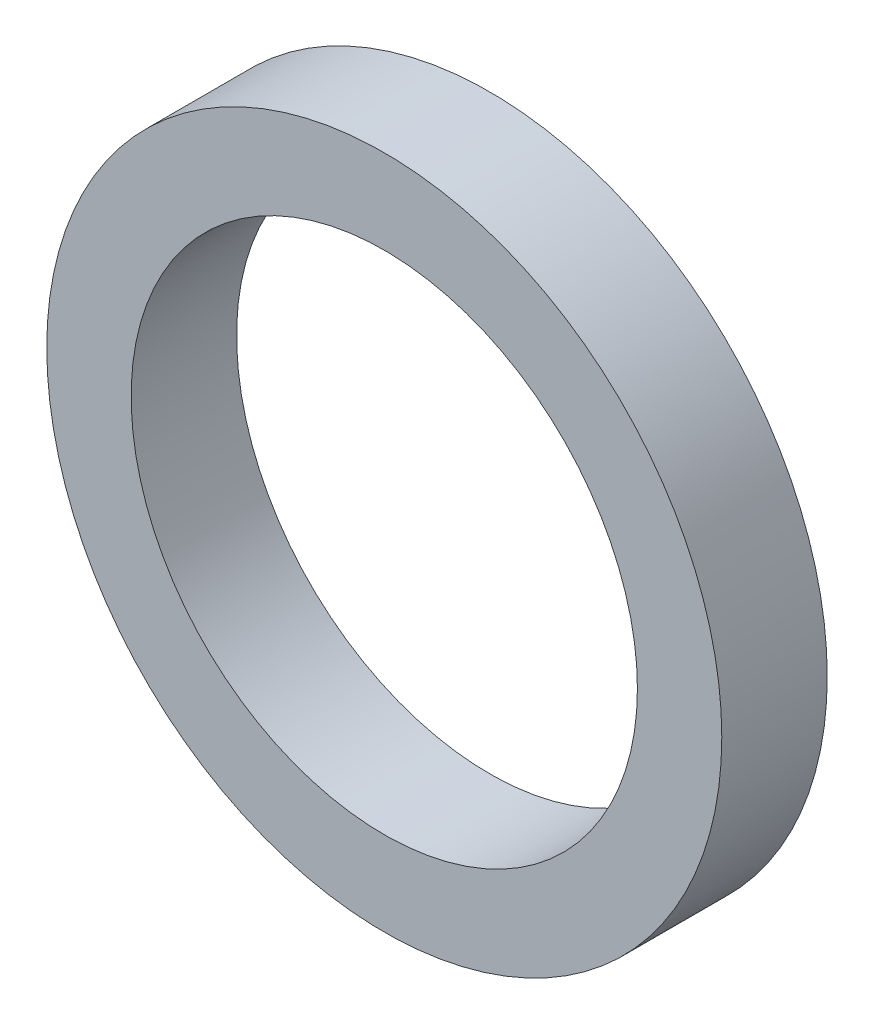
ISO-10303-21;
HEADER;
FILE_DESCRIPTION(('STEP AP214'),'2;1');
FILE_NAME('part.step','',(''),(''),'','','');
FILE_SCHEMA(('AUTOMOTIVE_DESIGN { 1 0 10303 214 1 1 1 1 }'));
ENDSEC;
DATA;
#1=APPLICATION_CONTEXT('core data for automotive mechanical design processes');
#2=APPLICATION_PROTOCOL_DEFINITION('international standard','automotive_design',2000,#1);
#3=PRODUCT_CONTEXT('',#1,'mechanical');
#4=PRODUCT('Part','Part','',(#3));
#5=PRODUCT_RELATED_PRODUCT_CATEGORY('part','',(#4));
#6=PRODUCT_DEFINITION_FORMATION('','',#4);
#7=PRODUCT_DEFINITION_CONTEXT('part definition',#1,'design');
#8=PRODUCT_DEFINITION('design','',#6,#7);
#9=PRODUCT_DEFINITION_SHAPE('','',#8);
#10=(LENGTH_UNIT() NAMED_UNIT(*) SI_UNIT(.MILLI.,.METRE.));
#11=(NAMED_UNIT(*) PLANE_ANGLE_UNIT() SI_UNIT($,.RADIAN.));
#12=(NAMED_UNIT(*) SI_UNIT($,.STERADIAN.) SOLID_ANGLE_UNIT());
#13=UNCERTAINTY_MEASURE_WITH_UNIT(LENGTH_MEASURE(1.E-05),#10,'distance_accuracy_value','');
#14=(GEOMETRIC_REPRESENTATION_CONTEXT(3) GLOBAL_UNCERTAINTY_ASSIGNED_CONTEXT((#13)) GLOBAL_UNIT_ASSIGNED_CONTEXT((#10,
#11,#12)) REPRESENTATION_CONTEXT('',''));
#15=CARTESIAN_POINT('',(0.,0.,0.));
#16=DIRECTION('',(0.,0.,1.));
#17=DIRECTION('',(1.,0.,0.));
#18=AXIS2_PLACEMENT_3D('',#15,#16,#17);
#19=CARTESIAN_POINT('',(0.,0.,3.96748));
#20=DIRECTION('',(0.,0.,1.));
#21=DIRECTION('',(1.,0.,0.));
#22=AXIS2_PLACEMENT_3D('',#19,#20,#21);
#23=PLANE('',#22);
#24=CARTESIAN_POINT('',(0.,0.,3.96748));
#25=DIRECTION('',(0.,0.,1.));
#26=DIRECTION('',(1.,0.,0.));
#27=AXIS2_PLACEMENT_3D('',#24,#25,#26);
#28=CIRCLE('',#27,12.7);
#29=CARTESIAN_POINT('',(12.7,0.,3.96748));
#30=VERTEX_POINT('',#29);
#31=EDGE_CURVE('E10',#30,#30,#28,.T.);
#32=ORIENTED_EDGE('',*,*,#31,.T.);
#33=EDGE_LOOP('',(#32));
#34=FACE_BOUND('',#33,.T.);
#35=CARTESIAN_POINT('',(0.,0.,3.96748));
#36=DIRECTION('',(0.,0.,1.));
#37=DIRECTION('',(1.,0.,0.));
#38=AXIS2_PLACEMENT_3D('',#35,#36,#37);
#39=CIRCLE('',#38,9.525);
#40=CARTESIAN_POINT('',(9.525,0.,3.96748));
#41=VERTEX_POINT('',#40);
#42=EDGE_CURVE('E41',#41,#41,#39,.T.);
#43=ORIENTED_EDGE('',*,*,#42,.F.);
#44=EDGE_LOOP('',(#43));
#45=FACE_BOUND('',#44,.T.);
#46=ADVANCED_FACE('F30',(#34,#45),#23,.T.);
#47=CARTESIAN_POINT('',(0.,0.,0.));
#48=DIRECTION('',(0.,0.,1.));
#49=DIRECTION('',(1.,0.,0.));
#50=AXIS2_PLACEMENT_3D('',#47,#48,#49);
#51=PLANE('',#50);
#52=CARTESIAN_POINT('',(0.,0.,0.));
#53=DIRECTION('',(0.,0.,1.));
#54=DIRECTION('',(1.,0.,0.));
#55=AXIS2_PLACEMENT_3D('',#52,#53,#54);
#56=CIRCLE('',#55,12.7);
#57=CARTESIAN_POINT('',(12.7,0.,0.));
#58=VERTEX_POINT('',#57);
#59=EDGE_CURVE('E34',#58,#58,#56,.T.);
#60=ORIENTED_EDGE('',*,*,#59,.F.);
#61=EDGE_LOOP('',(#60));
#62=FACE_BOUND('',#61,.T.);
#63=CARTESIAN_POINT('',(0.,0.,0.));
#64=DIRECTION('',(0.,0.,1.));
#65=DIRECTION('',(1.,0.,0.));
#66=AXIS2_PLACEMENT_3D('',#63,#64,#65);
#67=CIRCLE('',#66,9.525);
#68=CARTESIAN_POINT('',(9.525,0.,0.));
#69=VERTEX_POINT('',#68);
#70=EDGE_CURVE('E43',#69,#69,#67,.T.);
#71=ORIENTED_EDGE('',*,*,#70,.T.);
#72=EDGE_LOOP('',(#71));
#73=FACE_BOUND('',#72,.T.);
#74=ADVANCED_FACE('F53',(#62,#73),#51,.F.);
#75=CARTESIAN_POINT('',(0.,0.,3.96748));
#76=DIRECTION('',(0.,0.,-1.));
#77=DIRECTION('',(-1.,0.,0.));
#78=AXIS2_PLACEMENT_3D('',#75,#76,#77);
#79=CYLINDRICAL_SURFACE('',#78,12.7);
#80=ORIENTED_EDGE('',*,*,#31,.F.);
#81=EDGE_LOOP('',(#80));
#82=FACE_BOUND('',#81,.T.);
#83=ORIENTED_EDGE('',*,*,#59,.T.);
#84=EDGE_LOOP('',(#83));
#85=FACE_BOUND('',#84,.T.);
#86=ADVANCED_FACE('F32',(#82,#85),#79,.T.);
#87=CARTESIAN_POINT('',(0.,0.,3.96748));
#88=DIRECTION('',(0.,0.,-1.));
#89=DIRECTION('',(-1.,0.,0.));
#90=AXIS2_PLACEMENT_3D('',#87,#88,#89);
#91=CYLINDRICAL_SURFACE('',#90,9.525);
#92=ORIENTED_EDGE('',*,*,#42,.T.);
#93=EDGE_LOOP('',(#92));
#94=FACE_BOUND('',#93,.T.);
#95=ORIENTED_EDGE('',*,*,#70,.F.);
#96=EDGE_LOOP('',(#95));
#97=FACE_BOUND('',#96,.T.);
#98=ADVANCED_FACE('F49',(#94,#97),#91,.F.);
#99=CLOSED_SHELL('',(#46,#74,#86,#98));
#100=MANIFOLD_SOLID_BREP('B2',#99);
#101=ADVANCED_BREP_SHAPE_REPRESENTATION('',(#18,#100),#14);
#102=SHAPE_DEFINITION_REPRESENTATION(#9,#101);
ENDSEC;
END-ISO-10303-21;
